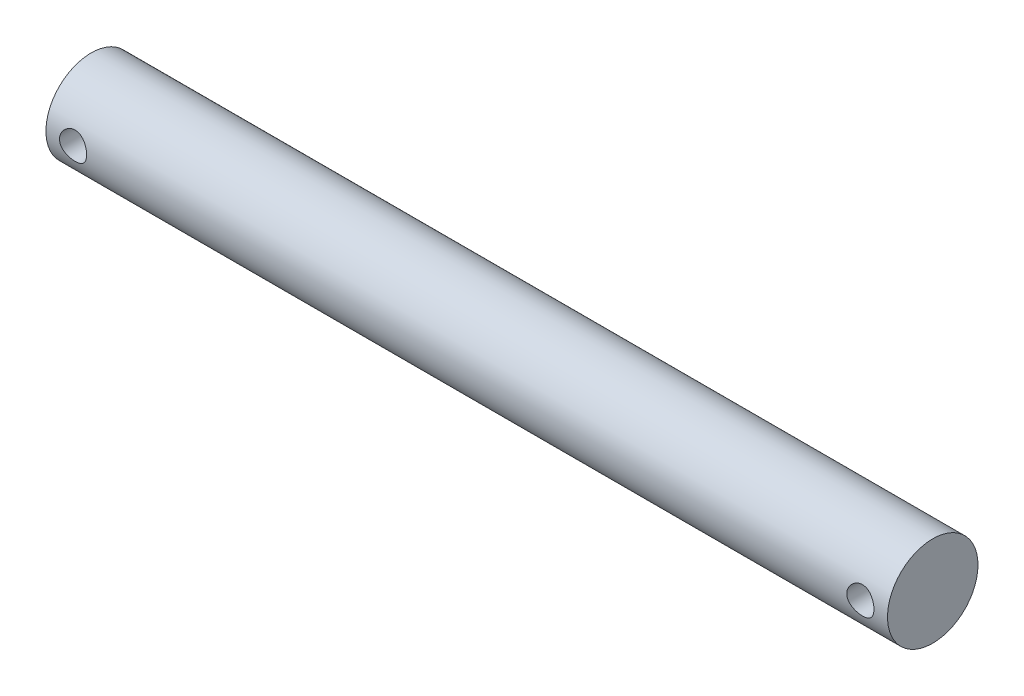
ISO-10303-21;
HEADER;
FILE_DESCRIPTION(('STEP AP214'),'2;1');
FILE_NAME('part.step','',(''),(''),'','','');
FILE_SCHEMA(('AUTOMOTIVE_DESIGN { 1 0 10303 214 1 1 1 1 }'));
ENDSEC;
DATA;
#1=APPLICATION_CONTEXT('core data for automotive mechanical design processes');
#2=APPLICATION_PROTOCOL_DEFINITION('international standard','automotive_design',2000,#1);
#3=PRODUCT_CONTEXT('',#1,'mechanical');
#4=PRODUCT('Part','Part','',(#3));
#5=PRODUCT_RELATED_PRODUCT_CATEGORY('part','',(#4));
#6=PRODUCT_DEFINITION_FORMATION('','',#4);
#7=PRODUCT_DEFINITION_CONTEXT('part definition',#1,'design');
#8=PRODUCT_DEFINITION('design','',#6,#7);
#9=PRODUCT_DEFINITION_SHAPE('','',#8);
#10=(LENGTH_UNIT() NAMED_UNIT(*) SI_UNIT(.MILLI.,.METRE.));
#11=(NAMED_UNIT(*) PLANE_ANGLE_UNIT() SI_UNIT($,.RADIAN.));
#12=(NAMED_UNIT(*) SI_UNIT($,.STERADIAN.) SOLID_ANGLE_UNIT());
#13=UNCERTAINTY_MEASURE_WITH_UNIT(LENGTH_MEASURE(1.E-05),#10,'distance_accuracy_value','');
#14=(GEOMETRIC_REPRESENTATION_CONTEXT(3) GLOBAL_UNCERTAINTY_ASSIGNED_CONTEXT((#13)) GLOBAL_UNIT_ASSIGNED_CONTEXT((#10,
#11,#12)) REPRESENTATION_CONTEXT('',''));
#15=CARTESIAN_POINT('',(0.,0.,0.));
#16=DIRECTION('',(0.,0.,1.));
#17=DIRECTION('',(1.,0.,0.));
#18=AXIS2_PLACEMENT_3D('',#15,#16,#17);
#19=CARTESIAN_POINT('',(93.0000000000005,1.94289029309402E-13,0.));
#20=DIRECTION('',(-1.,0.,0.));
#21=DIRECTION('',(0.,0.,0.999999999999999));
#22=AXIS2_PLACEMENT_3D('',#19,#20,#21);
#23=CYLINDRICAL_SURFACE('',#22,5.);
#24=CARTESIAN_POINT('',(93.0000000000005,1.94289029309402E-13,0.));
#25=DIRECTION('',(1.,0.,0.));
#26=DIRECTION('',(0.,0.,-0.999999999999999));
#27=AXIS2_PLACEMENT_3D('',#24,#25,#26);
#28=CIRCLE('',#27,5.);
#29=CARTESIAN_POINT('',(93.0000000000005,1.94326380074245E-13,-5.));
#30=VERTEX_POINT('',#29);
#31=EDGE_CURVE('E10',#30,#30,#28,.T.);
#32=ORIENTED_EDGE('',*,*,#31,.F.);
#33=EDGE_LOOP('',(#32));
#34=FACE_BOUND('',#33,.T.);
#35=CARTESIAN_POINT('',(0.,0.,0.));
#36=DIRECTION('',(1.,0.,0.));
#37=DIRECTION('',(0.,0.,-0.999999999999999));
#38=AXIS2_PLACEMENT_3D('',#35,#36,#37);
#39=CIRCLE('',#38,5.);
#40=CARTESIAN_POINT('',(0.,0.,-5.));
#41=VERTEX_POINT('',#40);
#42=EDGE_CURVE('E39',#41,#41,#39,.T.);
#43=ORIENTED_EDGE('',*,*,#42,.T.);
#44=EDGE_LOOP('',(#43));
#45=FACE_BOUND('',#44,.T.);
#46=CARTESIAN_POINT('',(91.5000000000002,0.,-5.00000000000001));
#47=CARTESIAN_POINT('',(91.4999990025153,-0.0822886127532704,-4.9999992925055));
#48=CARTESIAN_POINT('',(91.4932061363765,-0.164587318351527,-4.99794915693953));
#49=CARTESIAN_POINT('',(91.4662786457785,-0.326788125304866,-4.9899710559369));
#50=CARTESIAN_POINT('',(91.4461400419771,-0.406689504411366,-4.98404193389691));
#51=CARTESIAN_POINT('',(91.3932539830902,-0.561732707754503,-4.96895552501835));
#52=CARTESIAN_POINT('',(91.3605251303816,-0.636881364395417,-4.95980300250422));
#53=CARTESIAN_POINT('',(91.2834639069446,-0.780624181053168,-4.93922109237642));
#54=CARTESIAN_POINT('',(91.2391299926049,-0.849217467469631,-4.92779140192065));
#55=CARTESIAN_POINT('',(91.1387759925276,-0.979871797183728,-4.90350737192771));
#56=CARTESIAN_POINT('',(91.0824833741145,-1.04171807124443,-4.8906238365703));
#57=CARTESIAN_POINT('',(90.9603907700902,-1.15524920923319,-4.86505834210438));
#58=CARTESIAN_POINT('',(90.8945891878753,-1.20693236327412,-4.85237641724503));
#59=CARTESIAN_POINT('',(90.7535292469626,-1.29980037723675,-4.82834113993773));
#60=CARTESIAN_POINT('',(90.6780915390096,-1.34072309022203,-4.8170240666387));
#61=CARTESIAN_POINT('',(90.5210107457701,-1.40921394774765,-4.79743620394026));
#62=CARTESIAN_POINT('',(90.4393691560724,-1.43678529919971,-4.78916468313312));
#63=CARTESIAN_POINT('',(90.2746097338699,-1.4770163368264,-4.77690870838436));
#64=CARTESIAN_POINT('',(90.1915972561364,-1.49007196234662,-4.7728106932453));
#65=CARTESIAN_POINT('',(90.0244668437837,-1.50213730614667,-4.76902789749765));
#66=CARTESIAN_POINT('',(89.9403491819413,-1.50115042761088,-4.76934204760575));
#67=CARTESIAN_POINT('',(89.7766160913919,-1.48546977199815,-4.77424744067782));
#68=CARTESIAN_POINT('',(89.6969477496382,-1.47127205262668,-4.77868388599141));
#69=CARTESIAN_POINT('',(89.5411802137268,-1.43037420427039,-4.79108356228623));
#70=CARTESIAN_POINT('',(89.4650813726258,-1.40367284141645,-4.79904714132351));
#71=CARTESIAN_POINT('',(89.3173996503395,-1.33816026653682,-4.81772733074975));
#72=CARTESIAN_POINT('',(89.2458929160452,-1.29918816934619,-4.82848016115955));
#73=CARTESIAN_POINT('',(89.1102679779902,-1.21035222588663,-4.85150987000064));
#74=CARTESIAN_POINT('',(89.0461515705865,-1.16048574002595,-4.86378711746986));
#75=CARTESIAN_POINT('',(88.9243138092383,-1.04881290765561,-4.88911011297932));
#76=CARTESIAN_POINT('',(88.8669713359709,-0.986594907466896,-4.90216654310496));
#77=CARTESIAN_POINT('',(88.7634460159363,-0.853263259313839,-4.92712244063257));
#78=CARTESIAN_POINT('',(88.7172638715859,-0.782149051860926,-4.93902183518406));
#79=CARTESIAN_POINT('',(88.6371400775356,-0.632355038342886,-4.96043160069466));
#80=CARTESIAN_POINT('',(88.6032824837507,-0.553627749747908,-4.96992543668313));
#81=CARTESIAN_POINT('',(88.549400409901,-0.391245415603411,-4.98533521832221));
#82=CARTESIAN_POINT('',(88.5293720714678,-0.307591751589533,-4.99125216186997));
#83=CARTESIAN_POINT('',(88.5043478221009,-0.140952242668331,-4.99868364643536));
#84=CARTESIAN_POINT('',(88.498838414199,-0.0580500976011801,-5.0003485041779));
#85=CARTESIAN_POINT('',(88.5015691557126,0.107499605823416,-4.9995292324176));
#86=CARTESIAN_POINT('',(88.5098074696517,0.190147196690833,-4.99704565677755));
#87=CARTESIAN_POINT('',(88.5393846111117,0.35090360530971,-4.98830696987162));
#88=CARTESIAN_POINT('',(88.5604233875814,0.429072772614126,-4.98213829799418));
#89=CARTESIAN_POINT('',(88.6146432327788,0.580754638954529,-4.96674347841535));
#90=CARTESIAN_POINT('',(88.6478257610382,0.654266777025698,-4.95751696321087));
#91=CARTESIAN_POINT('',(88.7262531654814,0.796437189461157,-4.93669654351328));
#92=CARTESIAN_POINT('',(88.7717593409484,0.864943826199656,-4.9250528082968));
#93=CARTESIAN_POINT('',(88.8732247540533,0.993523307980053,-4.90073468764321));
#94=CARTESIAN_POINT('',(88.929186611888,1.05359403235588,-4.88806004431079));
#95=CARTESIAN_POINT('',(89.0523873083697,1.16585744551026,-4.86253171869139));
#96=CARTESIAN_POINT('',(89.1199618757721,1.21768481231502,-4.84968825033274));
#97=CARTESIAN_POINT('',(89.2631279390139,1.30928995072153,-4.82576515238467));
#98=CARTESIAN_POINT('',(89.3387192245586,1.34906803829472,-4.81468547654648));
#99=CARTESIAN_POINT('',(89.4955324912551,1.41517347127171,-4.79567189615051));
#100=CARTESIAN_POINT('',(89.576726186537,1.44156346937056,-4.7877233784383));
#101=CARTESIAN_POINT('',(89.7426879689318,1.4802173081512,-4.77591594362798));
#102=CARTESIAN_POINT('',(89.827454820788,1.49248598978781,-4.77205562508298));
#103=CARTESIAN_POINT('',(89.9943615183766,1.50221984485064,-4.76899972496083));
#104=CARTESIAN_POINT('',(90.076463651018,1.500280553085,-4.76961647442757));
#105=CARTESIAN_POINT('',(90.2391141033733,1.48307505444827,-4.77499401288296));
#106=CARTESIAN_POINT('',(90.3196624851769,1.46780938124728,-4.77975463592547));
#107=CARTESIAN_POINT('',(90.4759453991434,1.42476888804148,-4.79275763670381));
#108=CARTESIAN_POINT('',(90.5517272873622,1.39715175507083,-4.80095604545965));
#109=CARTESIAN_POINT('',(90.6976424388182,1.33031507121141,-4.81990278909139));
#110=CARTESIAN_POINT('',(90.7677746176412,1.29109329962884,-4.83065161194312));
#111=CARTESIAN_POINT('',(90.9031631165276,1.20048763805083,-4.85397676425832));
#112=CARTESIAN_POINT('',(90.968148761261,1.14871276093014,-4.86660540163798));
#113=CARTESIAN_POINT('',(91.0887024983083,1.03517434629794,-4.89201320450026));
#114=CARTESIAN_POINT('',(91.1442681394681,0.973408217134454,-4.90479240823902));
#115=CARTESIAN_POINT('',(91.2460234122954,0.839465762183162,-4.92950936570646));
#116=CARTESIAN_POINT('',(91.291891446856,0.767037885790666,-4.94141159765674));
#117=CARTESIAN_POINT('',(91.3707351699046,0.615141373983711,-4.96260680455815));
#118=CARTESIAN_POINT('',(91.403716888275,0.535676052999117,-4.97190099931069));
#119=CARTESIAN_POINT('',(91.4528952756533,0.380757712655445,-4.98602174969302));
#120=CARTESIAN_POINT('',(91.4705116728839,0.30578696195441,-4.99122027381068));
#121=CARTESIAN_POINT('',(91.4940635252421,0.153880195230924,-4.99820944494492));
#122=CARTESIAN_POINT('',(91.500000932705,0.07694450985824,-5.00000066154741));
#123=CARTESIAN_POINT('',(91.5000000000002,0.,-5.00000000000001));
#124=B_SPLINE_CURVE_WITH_KNOTS('',3,(#46,#47,#48,#49,#50,#51,#52,#53,#54,#55,#56,#57,#58,#59,
#60,#61,#62,#63,#64,#65,#66,#67,#68,#69,#70,#71,#72,#73,#74,#75,#76,#77,#78,#79,#80,#81,#82,#83,
#84,#85,#86,#87,#88,#89,#90,#91,#92,#93,#94,#95,#96,#97,#98,#99,#100,#101,#102,#103,#104,#105,
#106,#107,#108,#109,#110,#111,#112,#113,#114,#115,#116,#117,#118,#119,#120,#121,#122,#123),
.UNSPECIFIED.,.T.,.F.,(4,2,2,2,2,2,2,2,2,2,2,2,2,2,2,2,2,2,2,2,2,2,2,2,2,2,2,2,2,2,2,2,2,2,2,2,
2,2,4),(0.,0.246583203612636,0.493239964845997,0.739533676300944,0.985860164412863,
1.23855602948198,1.49129437288632,1.74971481004111,2.00807314543228,2.25919689356598,
2.51025978319083,2.75226016697681,2.99428443658018,3.23962426447126,3.48502360158549,
3.74067104048159,3.99633456531062,4.25371046881683,4.51101453528805,4.75908809438539,
5.00712853550317,5.24956746682321,5.49203554593727,5.740113057029,5.98825282000174,
6.24540400322809,6.50254844252675,6.75847814951242,7.0143200946027,7.25950155466941,
7.50467319661609,7.74680040402727,7.98897397553108,8.23996925679931,8.49102974897509,
8.74942996156676,9.00770911595231,9.23831691930457,9.46888616948881),.UNSPECIFIED.);
#125=CARTESIAN_POINT('',(91.5000000000002,0.,-5.00000000000001));
#126=VERTEX_POINT('',#125);
#127=EDGE_CURVE('E57',#126,#126,#124,.T.);
#128=ORIENTED_EDGE('',*,*,#127,.F.);
#129=EDGE_LOOP('',(#128));
#130=FACE_BOUND('',#129,.T.);
#131=CARTESIAN_POINT('',(88.5000000000001,-1.66533453693773E-13,5.));
#132=CARTESIAN_POINT('',(88.500000997485,0.0822886127531094,4.99999929250551));
#133=CARTESIAN_POINT('',(88.5067938636244,0.16458731835131,4.99794915693956));
#134=CARTESIAN_POINT('',(88.5337213542226,0.326788125304686,4.98997105593692));
#135=CARTESIAN_POINT('',(88.5538599580236,0.406689504411278,4.98404193389689));
#136=CARTESIAN_POINT('',(88.6067460169104,0.561732707754454,4.96895552501835));
#137=CARTESIAN_POINT('',(88.6394748696193,0.636881364395313,4.95980300250428));
#138=CARTESIAN_POINT('',(88.7165360930563,0.780624181053171,4.93922109237648));
#139=CARTESIAN_POINT('',(88.7608700073959,0.849217467469795,4.92779140192065));
#140=CARTESIAN_POINT('',(88.8612240074732,0.97987179718391,4.90350737192771));
#141=CARTESIAN_POINT('',(88.9175166258864,1.04171807124446,4.89062383657037));
#142=CARTESIAN_POINT('',(89.0396092299107,1.15524920923336,4.86505834210445));
#143=CARTESIAN_POINT('',(89.1054108121254,1.20693236327458,4.85237641724502));
#144=CARTESIAN_POINT('',(89.246470753038,1.29980037723723,4.82834113993773));
#145=CARTESIAN_POINT('',(89.3219084609912,1.34072309022222,4.81702406663878));
#146=CARTESIAN_POINT('',(89.4789892542307,1.40921394774769,4.79743620394034));
#147=CARTESIAN_POINT('',(89.5606308439284,1.43678529919989,4.78916468313311));
#148=CARTESIAN_POINT('',(89.7253902661309,1.47701633682667,4.77690870838434));
#149=CARTESIAN_POINT('',(89.8084027438644,1.49007196234687,4.77281069324535));
#150=CARTESIAN_POINT('',(89.9755331562172,1.50213730614683,4.76902789749771));
#151=CARTESIAN_POINT('',(90.0596508180595,1.50115042761096,4.76934204760574));
#152=CARTESIAN_POINT('',(90.2233839086089,1.48546977199832,4.7742474406778));
#153=CARTESIAN_POINT('',(90.3030522503626,1.47127205262703,4.77868388599142));
#154=CARTESIAN_POINT('',(90.4588197862738,1.43037420427068,4.79108356228625));
#155=CARTESIAN_POINT('',(90.5349186273746,1.40367284141651,4.79904714132351));
#156=CARTESIAN_POINT('',(90.682600349661,1.33816026653699,4.81772733074973));
#157=CARTESIAN_POINT('',(90.7541070839556,1.2991881693467,4.82848016115953));
#158=CARTESIAN_POINT('',(90.8897320220105,1.21035222588702,4.85150987000062));
#159=CARTESIAN_POINT('',(90.9538484294139,1.1604857400259,4.86378711746985));
#160=CARTESIAN_POINT('',(91.0756861907622,1.04881290765548,4.88911011297931));
#161=CARTESIAN_POINT('',(91.13302866403,0.986594907467184,4.90216654310496));
#162=CARTESIAN_POINT('',(91.2365539840646,0.853263259314285,4.92712244063257));
#163=CARTESIAN_POINT('',(91.2827361284147,0.782149051861117,4.93902183518405));
#164=CARTESIAN_POINT('',(91.362859922465,0.632355038343,4.96043160069465));
#165=CARTESIAN_POINT('',(91.3967175162503,0.553627749748202,4.96992543668313));
#166=CARTESIAN_POINT('',(91.4505995901001,0.391245415603748,4.98533521832222));
#167=CARTESIAN_POINT('',(91.4706279285327,0.307591751589734,4.99125216186996));
#168=CARTESIAN_POINT('',(91.4956521778997,0.140952242668422,4.99868364643535));
#169=CARTESIAN_POINT('',(91.5011615858021,0.0580500976012905,5.0003485041779));
#170=CARTESIAN_POINT('',(91.4984308442884,-0.107499605823242,4.9995292324176));
#171=CARTESIAN_POINT('',(91.4901925303488,-0.190147196690615,4.99704565677755));
#172=CARTESIAN_POINT('',(91.4606153888887,-0.350903605309558,4.98830696987161));
#173=CARTESIAN_POINT('',(91.4395766124196,-0.429072772614081,4.98213829799415));
#174=CARTESIAN_POINT('',(91.3853567672223,-0.5807546389544,4.96674347841533));
#175=CARTESIAN_POINT('',(91.3521742389625,-0.654266777025378,4.95751696321086));
#176=CARTESIAN_POINT('',(91.2737468345192,-0.796437189460875,4.93669654351325));
#177=CARTESIAN_POINT('',(91.2282406590525,-0.864943826199604,4.92505280829673));
#178=CARTESIAN_POINT('',(91.1267752459476,-0.993523307980039,4.90073468764315));
#179=CARTESIAN_POINT('',(91.0708133881126,-1.05359403235567,4.8880600443108));
#180=CARTESIAN_POINT('',(90.9476126916308,-1.16585744551002,4.86253171869137));
#181=CARTESIAN_POINT('',(90.8800381242286,-1.21768481231497,4.84968825033265));
#182=CARTESIAN_POINT('',(90.7368720609869,-1.30928995072153,4.82576515238458));
#183=CARTESIAN_POINT('',(90.6612807754422,-1.34906803829459,4.81468547654645));
#184=CARTESIAN_POINT('',(90.5044675087456,-1.41517347127149,4.7956718961505));
#185=CARTESIAN_POINT('',(90.4232738134638,-1.44156346937037,4.78772337843824));
#186=CARTESIAN_POINT('',(90.2573120310689,-1.48021730815109,4.77591594362791));
#187=CARTESIAN_POINT('',(90.1725451792128,-1.49248598978776,4.77205562508296));
#188=CARTESIAN_POINT('',(90.0056384816242,-1.50221984485052,4.76899972496083));
#189=CARTESIAN_POINT('',(89.9235363489829,-1.50028055308478,4.76961647442753));
#190=CARTESIAN_POINT('',(89.7608858966276,-1.48307505444802,4.77499401288292));
#191=CARTESIAN_POINT('',(89.6803375148241,-1.46780938124709,4.77975463592546));
#192=CARTESIAN_POINT('',(89.5240546008576,-1.42476888804126,4.79275763670381));
#193=CARTESIAN_POINT('',(89.4482727126387,-1.3971517550705,4.80095604545964));
#194=CARTESIAN_POINT('',(89.3023575611826,-1.33031507121113,4.81990278909137));
#195=CARTESIAN_POINT('',(89.2322253823594,-1.29109329962871,4.83065161194309));
#196=CARTESIAN_POINT('',(89.0968368834731,-1.20048763805064,4.85397676425831));
#197=CARTESIAN_POINT('',(89.0318512387399,-1.14871276092972,4.86660540163799));
#198=CARTESIAN_POINT('',(88.9112975016925,-1.03517434629758,4.89201320450027));
#199=CARTESIAN_POINT('',(88.8557318605325,-0.97340821713438,4.90479240823902));
#200=CARTESIAN_POINT('',(88.7539765877053,-0.839465762183185,4.92950936570644));
#201=CARTESIAN_POINT('',(88.7081085531449,-0.767037885790476,4.94141159765672));
#202=CARTESIAN_POINT('',(88.6292648300965,-0.615141373983352,4.96260680455814));
#203=CARTESIAN_POINT('',(88.596283111726,-0.535676052998798,4.97190099931067));
#204=CARTESIAN_POINT('',(88.5471047243478,-0.380757712655173,4.98602174969301));
#205=CARTESIAN_POINT('',(88.5294883271174,-0.30578696195416,4.99122027381067));
#206=CARTESIAN_POINT('',(88.5059364747588,-0.153880195230806,4.99820944494491));
#207=CARTESIAN_POINT('',(88.4999990672953,-0.0769445098582341,5.00000066154739));
#208=CARTESIAN_POINT('',(88.5000000000001,-1.66533453693773E-13,5.));
#209=B_SPLINE_CURVE_WITH_KNOTS('',3,(#131,#132,#133,#134,#135,#136,#137,#138,#139,#140,#141,
#142,#143,#144,#145,#146,#147,#148,#149,#150,#151,#152,#153,#154,#155,#156,#157,#158,#159,#160,
#161,#162,#163,#164,#165,#166,#167,#168,#169,#170,#171,#172,#173,#174,#175,#176,#177,#178,#179,
#180,#181,#182,#183,#184,#185,#186,#187,#188,#189,#190,#191,#192,#193,#194,#195,#196,#197,#198,
#199,#200,#201,#202,#203,#204,#205,#206,#207,#208),.UNSPECIFIED.,.T.,.F.,(4,2,2,2,2,2,2,2,2,2,2,
2,2,2,2,2,2,2,2,2,2,2,2,2,2,2,2,2,2,2,2,2,2,2,2,2,2,2,4),(0.,0.246583203612592,
0.493239964845996,0.739533676301079,0.985860164413107,1.23855602948228,1.49129437288665,
1.74971481004139,2.00807314543253,2.2591968935663,2.51025978319119,2.75226016697697,
2.99428443658013,3.23962426447132,3.48502360158571,3.74067104048178,3.99633456531077,
4.25371046881703,4.51101453528831,4.75908809438568,5.0071285355035,5.24956746682347,
5.49203554593743,5.74011305702928,5.98825282000219,6.24540400322844,6.50254844252703,
6.75847814951272,7.01432009460299,7.25950155466958,7.50467319661615,7.74680040402748,
7.98897397553145,8.23996925679964,8.49102974897529,8.74942996156693,9.00770911595257,
9.23831691930469,9.46888616948868),.UNSPECIFIED.);
#210=CARTESIAN_POINT('',(88.5000000000001,-1.66533453693773E-13,5.));
#211=VERTEX_POINT('',#210);
#212=EDGE_CURVE('E48',#211,#211,#209,.T.);
#213=ORIENTED_EDGE('',*,*,#212,.T.);
#214=EDGE_LOOP('',(#213));
#215=FACE_BOUND('',#214,.T.);
#216=CARTESIAN_POINT('',(4.50000000000028,-1.66533453693773E-13,-5.00000000000001));
#217=CARTESIAN_POINT('',(4.49999900251539,-0.0822886127534523,-4.9999992925055));
#218=CARTESIAN_POINT('',(4.49320613637602,-0.164587318351663,-4.99794915693953));
#219=CARTESIAN_POINT('',(4.46627864577784,-0.326788125305058,-4.9899710559369));
#220=CARTESIAN_POINT('',(4.44614004197684,-0.406689504411659,-4.98404193389691));
#221=CARTESIAN_POINT('',(4.39325398308993,-0.561732707754727,-4.96895552501836));
#222=CARTESIAN_POINT('',(4.36052513038103,-0.636881364395473,-4.95980300250425));
#223=CARTESIAN_POINT('',(4.28346390694407,-0.780624181053241,-4.93922109237644));
#224=CARTESIAN_POINT('',(4.23912999260467,-0.849217467469889,-4.92779140192065));
#225=CARTESIAN_POINT('',(4.13877599252746,-0.979871797183912,-4.90350737192773));
#226=CARTESIAN_POINT('',(4.08248337411407,-1.04171807124434,-4.89062383657036));
#227=CARTESIAN_POINT('',(3.96039077008983,-1.15524920923323,-4.86505834210444));
#228=CARTESIAN_POINT('',(3.89458918787523,-1.20693236327456,-4.85237641724503));
#229=CARTESIAN_POINT('',(3.75352924696266,-1.29980037723723,-4.82834113993774));
#230=CARTESIAN_POINT('',(3.67809153900943,-1.34072309022211,-4.81702406663877));
#231=CARTESIAN_POINT('',(3.52101074576981,-1.40921394774751,-4.79743620394033));
#232=CARTESIAN_POINT('',(3.43936915607217,-1.43678529919974,-4.78916468313312));
#233=CARTESIAN_POINT('',(3.27460973386973,-1.47701633682656,-4.77690870838435));
#234=CARTESIAN_POINT('',(3.19159725613626,-1.49007196234676,-4.77281069324534));
#235=CARTESIAN_POINT('',(3.02446684378348,-1.50213730614671,-4.7690278974977));
#236=CARTESIAN_POINT('',(2.94034918194119,-1.50115042761084,-4.76934204760576));
#237=CARTESIAN_POINT('',(2.77661609139183,-1.48546977199822,-4.7742474406778));
#238=CARTESIAN_POINT('',(2.69694774963807,-1.47127205262693,-4.77868388599139));
#239=CARTESIAN_POINT('',(2.54118021372684,-1.43037420427064,-4.79108356228622));
#240=CARTESIAN_POINT('',(2.46508137262596,-1.40367284141651,-4.79904714132352));
#241=CARTESIAN_POINT('',(2.31739965033954,-1.33816026653696,-4.81772733074974));
#242=CARTESIAN_POINT('',(2.245892916045,-1.29918816934659,-4.8284801611595));
#243=CARTESIAN_POINT('',(2.11026797799008,-1.21035222588703,-4.85150987000059));
#244=CARTESIAN_POINT('',(2.0461515705865,-1.16048574002611,-4.86378711746987));
#245=CARTESIAN_POINT('',(1.92431380923821,-1.04881290765574,-4.88911011297933));
#246=CARTESIAN_POINT('',(1.86697133597051,-0.986594907467275,-4.90216654310493));
#247=CARTESIAN_POINT('',(1.76344601593598,-0.853263259314216,-4.92712244063254));
#248=CARTESIAN_POINT('',(1.7172638715859,-0.782149051861054,-4.93902183518406));
#249=CARTESIAN_POINT('',(1.63714007753553,-0.632355038342926,-4.96043160069468));
#250=CARTESIAN_POINT('',(1.60328248375023,-0.553627749748111,-4.96992543668313));
#251=CARTESIAN_POINT('',(1.54940040990037,-0.391245415603684,-4.98533521832221));
#252=CARTESIAN_POINT('',(1.52937207146757,-0.307591751589713,-4.99125216186997));
#253=CARTESIAN_POINT('',(1.50434782210063,-0.140952242668434,-4.99868364643537));
#254=CARTESIAN_POINT('',(1.4988384141983,-0.0580500976012934,-5.0003485041779));
#255=CARTESIAN_POINT('',(1.50156915571215,0.10749960582324,-4.9995292324176));
#256=CARTESIAN_POINT('',(1.50980746965177,0.190147196690605,-4.99704565677756));
#257=CARTESIAN_POINT('',(1.53938461111178,0.350903605309579,-4.98830696987162));
#258=CARTESIAN_POINT('',(1.56042338758086,0.42907277261414,-4.98213829799416));
#259=CARTESIAN_POINT('',(1.61464323277816,0.580754638954455,-4.96674347841534));
#260=CARTESIAN_POINT('',(1.6478257610381,0.654266777025392,-4.95751696321088));
#261=CARTESIAN_POINT('',(1.72625316548141,0.796437189460913,-4.93669654351327));
#262=CARTESIAN_POINT('',(1.77175934094802,0.864943826199712,-4.92505280829674));
#263=CARTESIAN_POINT('',(1.87322475405284,0.993523307980223,-4.90073468764316));
#264=CARTESIAN_POINT('',(1.92918661188792,1.05359403235586,-4.88806004431081));
#265=CARTESIAN_POINT('',(2.05238730836967,1.16585744551021,-4.86253171869139));
#266=CARTESIAN_POINT('',(2.11996187577191,1.21768481231515,-4.84968825033266));
#267=CARTESIAN_POINT('',(2.26312793901365,1.30928995072161,-4.82576515238459));
#268=CARTESIAN_POINT('',(2.33871922455843,1.34906803829458,-4.81468547654647));
#269=CARTESIAN_POINT('',(2.49553249125494,1.41517347127153,-4.79567189615052));
#270=CARTESIAN_POINT('',(2.57672618653678,1.44156346937054,-4.78772337843825));
#271=CARTESIAN_POINT('',(2.74268796893165,1.48021730815119,-4.77591594362792));
#272=CARTESIAN_POINT('',(2.82745482078787,1.49248598978765,-4.77205562508297));
#273=CARTESIAN_POINT('',(2.99436151837647,1.50221984485041,-4.76899972496085));
#274=CARTESIAN_POINT('',(3.07646365101782,1.50028055308485,-4.76961647442755));
#275=CARTESIAN_POINT('',(3.23911410337304,1.48307505444814,-4.77499401288294));
#276=CARTESIAN_POINT('',(3.31966248517659,1.46780938124708,-4.77975463592547));
#277=CARTESIAN_POINT('',(3.4759453991431,1.42476888804122,-4.79275763670382));
#278=CARTESIAN_POINT('',(3.55172728736195,1.39715175507055,-4.80095604545967));
#279=CARTESIAN_POINT('',(3.69764243881801,1.33031507121117,-4.8199027890914));
#280=CARTESIAN_POINT('',(3.76777461764107,1.29109329962864,-4.83065161194311));
#281=CARTESIAN_POINT('',(3.9031631165274,1.20048763805055,-4.85397676425833));
#282=CARTESIAN_POINT('',(3.96814876126064,1.14871276092974,-4.86660540163802));
#283=CARTESIAN_POINT('',(4.08870249830806,1.0351743462976,-4.8920132045003));
#284=CARTESIAN_POINT('',(4.14426813946798,0.973408217134293,-4.90479240823903));
#285=CARTESIAN_POINT('',(4.2460234122952,0.839465762183022,-4.92950936570646));
#286=CARTESIAN_POINT('',(4.29189144685557,0.767037885790348,-4.94141159765676));
#287=CARTESIAN_POINT('',(4.37073516990418,0.615141373983292,-4.96260680455818));
#288=CARTESIAN_POINT('',(4.40371688827482,0.535676052998772,-4.97190099931069));
#289=CARTESIAN_POINT('',(4.45289527565297,0.38075771265511,-4.98602174969302));
#290=CARTESIAN_POINT('',(4.47051167288326,0.305786961954031,-4.99122027381068));
#291=CARTESIAN_POINT('',(4.49406352524162,0.153880195230566,-4.99820944494493));
#292=CARTESIAN_POINT('',(4.5000009327051,0.0769445098579479,-5.00000066154741));
#293=CARTESIAN_POINT('',(4.50000000000028,-1.66533453693773E-13,-5.00000000000001));
#294=B_SPLINE_CURVE_WITH_KNOTS('',3,(#216,#217,#218,#219,#220,#221,#222,#223,#224,#225,#226,
#227,#228,#229,#230,#231,#232,#233,#234,#235,#236,#237,#238,#239,#240,#241,#242,#243,#244,#245,
#246,#247,#248,#249,#250,#251,#252,#253,#254,#255,#256,#257,#258,#259,#260,#261,#262,#263,#264,
#265,#266,#267,#268,#269,#270,#271,#272,#273,#274,#275,#276,#277,#278,#279,#280,#281,#282,#283,
#284,#285,#286,#287,#288,#289,#290,#291,#292,#293),.UNSPECIFIED.,.T.,.F.,(4,2,2,2,2,2,2,2,2,2,2,
2,2,2,2,2,2,2,2,2,2,2,2,2,2,2,2,2,2,2,2,2,2,2,2,2,2,2,4),(0.,0.246583203612626,
0.493239964846027,0.739533676300891,0.985860164412719,1.23855602948184,1.49129437288615,
1.74971481004091,2.00807314543207,2.25919689356575,2.51025978319056,2.75226016697643,
2.9942844365797,3.23962426447086,3.48502360158517,3.7406710404813,3.99633456531041,
4.25371046881668,4.51101453528792,4.75908809438527,5.0071285355031,5.24956746682312,
5.49203554593712,5.740113057029,5.98825282000193,6.24540400322817,6.50254844252675,
6.75847814951248,7.0143200946028,7.25950155466941,7.50467319661599,7.74680040402725,
7.98897397553116,8.23996925679936,8.49102974897506,8.74942996156674,9.00770911595237,
9.23831691930459,9.46888616948871),.UNSPECIFIED.);
#295=CARTESIAN_POINT('',(4.50000000000028,-1.66533453693773E-13,-5.00000000000001));
#296=VERTEX_POINT('',#295);
#297=EDGE_CURVE('E56',#296,#296,#294,.T.);
#298=ORIENTED_EDGE('',*,*,#297,.F.);
#299=EDGE_LOOP('',(#298));
#300=FACE_BOUND('',#299,.T.);
#301=CARTESIAN_POINT('',(1.50000000000027,-2.77555756156289E-13,5.));
#302=CARTESIAN_POINT('',(1.50000099748515,0.0822886127530453,4.9999992925055));
#303=CARTESIAN_POINT('',(1.50679386362412,0.164587318351302,4.99794915693955));
#304=CARTESIAN_POINT('',(1.53372135422229,0.326788125304661,4.98997105593691));
#305=CARTESIAN_POINT('',(1.55385995802368,0.406689504411179,4.98404193389689));
#306=CARTESIAN_POINT('',(1.60674601691063,0.561732707754301,4.96895552501835));
#307=CARTESIAN_POINT('',(1.63947486961919,0.636881364395184,4.95980300250428));
#308=CARTESIAN_POINT('',(1.71653609305599,0.78062418105296,4.93922109237647));
#309=CARTESIAN_POINT('',(1.76087000739557,0.84921746746948,4.92779140192063));
#310=CARTESIAN_POINT('',(1.86122400747285,0.979871797183514,4.90350737192771));
#311=CARTESIAN_POINT('',(1.91751662588611,1.04171807124409,4.8906238365704));
#312=CARTESIAN_POINT('',(2.03960922991034,1.15524920923301,4.86505834210448));
#313=CARTESIAN_POINT('',(2.10541081212506,1.20693236327424,4.85237641724502));
#314=CARTESIAN_POINT('',(2.2464707530377,1.29980037723689,4.82834113993774));
#315=CARTESIAN_POINT('',(2.32190846099087,1.34072309022187,4.81702406663882));
#316=CARTESIAN_POINT('',(2.47898925423042,1.40921394774734,4.79743620394037));
#317=CARTESIAN_POINT('',(2.56063084392806,1.43678529919955,4.7891646831331));
#318=CARTESIAN_POINT('',(2.72539026613053,1.47701633682635,4.77690870838434));
#319=CARTESIAN_POINT('',(2.80840274386405,1.49007196234654,4.7728106932454));
#320=CARTESIAN_POINT('',(2.97553315621692,1.50213730614645,4.76902789749775));
#321=CARTESIAN_POINT('',(3.05965081805926,1.50115042761056,4.76934204760574));
#322=CARTESIAN_POINT('',(3.22338390860867,1.48546977199789,4.77424744067781));
#323=CARTESIAN_POINT('',(3.30305225036242,1.47127205262658,4.77868388599148));
#324=CARTESIAN_POINT('',(3.45881978627369,1.43037420427031,4.79108356228631));
#325=CARTESIAN_POINT('',(3.53491862737461,1.40367284141623,4.79904714132351));
#326=CARTESIAN_POINT('',(3.68260034966098,1.33816026653663,4.81772733074974));
#327=CARTESIAN_POINT('',(3.75410708395542,1.29918816934616,4.82848016115959));
#328=CARTESIAN_POINT('',(3.88973202201036,1.21035222588661,4.85150987000069));
#329=CARTESIAN_POINT('',(3.95384842941402,1.16048574002578,4.86378711746986));
#330=CARTESIAN_POINT('',(4.07568619076226,1.0488129076554,4.88911011297931));
#331=CARTESIAN_POINT('',(4.13302866402982,0.98659490746682,4.90216654310501));
#332=CARTESIAN_POINT('',(4.23655398406435,0.85326325931373,4.92712244063262));
#333=CARTESIAN_POINT('',(4.28273612841456,0.782149051860654,4.93902183518406));
#334=CARTESIAN_POINT('',(4.3628599224649,0.632355038342569,4.96043160069465));
#335=CARTESIAN_POINT('',(4.39671751625002,0.553627749747713,4.96992543668315));
#336=CARTESIAN_POINT('',(4.4505995900998,0.391245415603283,4.98533521832225));
#337=CARTESIAN_POINT('',(4.47062792853267,0.30759175158935,4.99125216186997));
#338=CARTESIAN_POINT('',(4.49565217789958,0.140952242668109,4.99868364643535));
#339=CARTESIAN_POINT('',(4.50116158580179,0.0580500976009686,5.00034850417789));
#340=CARTESIAN_POINT('',(4.49843084428807,-0.107499605823597,4.9995292324176));
#341=CARTESIAN_POINT('',(4.4901925303487,-0.190147196690994,4.99704565677756));
#342=CARTESIAN_POINT('',(4.46061538888865,-0.350903605309885,4.98830696987161));
#343=CARTESIAN_POINT('',(4.43957661241931,-0.429072772614333,4.98213829799414));
#344=CARTESIAN_POINT('',(4.38535676722204,-0.580754638954638,4.96674347841532));
#345=CARTESIAN_POINT('',(4.35217423896241,-0.654266777025676,4.95751696321087));
#346=CARTESIAN_POINT('',(4.27374683451918,-0.796437189461156,4.93669654351326));
#347=CARTESIAN_POINT('',(4.22824065905233,-0.864943826199803,4.92505280829673));
#348=CARTESIAN_POINT('',(4.1267752459474,-0.993523307980286,4.90073468764315));
#349=CARTESIAN_POINT('',(4.07081338811246,-1.05359403235605,4.88806004431081));
#350=CARTESIAN_POINT('',(3.94761269163077,-1.1658574455104,4.86253171869138));
#351=CARTESIAN_POINT('',(3.88003812422846,-1.21768481231521,4.84968825033264));
#352=CARTESIAN_POINT('',(3.73687206098678,-1.30928995072175,4.82576515238458));
#353=CARTESIAN_POINT('',(3.66128077544213,-1.34906803829493,4.81468547654646));
#354=CARTESIAN_POINT('',(3.50446750874567,-1.4151734712719,4.7956718961505));
#355=CARTESIAN_POINT('',(3.42327381346375,-1.44156346937072,4.7877233784382));
#356=CARTESIAN_POINT('',(3.2573120310688,-1.48021730815135,4.77591594362789));
#357=CARTESIAN_POINT('',(3.17254517921258,-1.49248598978797,4.77205562508297));
#358=CARTESIAN_POINT('',(3.00563848162398,-1.5022198448508,4.76899972496083));
#359=CARTESIAN_POINT('',(2.92353634898261,-1.50028055308516,4.76961647442748));
#360=CARTESIAN_POINT('',(2.7608858966274,-1.48307505444838,4.77499401288287));
#361=CARTESIAN_POINT('',(2.68033751482386,-1.46780938124733,4.77975463592546));
#362=CARTESIAN_POINT('',(2.52405460085734,-1.42476888804153,4.79275763670381));
#363=CARTESIAN_POINT('',(2.44827271263846,-1.39715175507093,4.80095604545958));
#364=CARTESIAN_POINT('',(2.30235756118242,-1.33031507121153,4.81990278909131));
#365=CARTESIAN_POINT('',(2.23222538235943,-1.29109329962893,4.83065161194309));
#366=CARTESIAN_POINT('',(2.09683688347307,-1.20048763805087,4.85397676425831));
#367=CARTESIAN_POINT('',(2.03185123873971,-1.14871276093017,4.86660540163794));
#368=CARTESIAN_POINT('',(1.9112975016923,-1.03517434629805,4.89201320450021));
#369=CARTESIAN_POINT('',(1.8557318605325,-0.973408217134665,4.90479240823901));
#370=CARTESIAN_POINT('',(1.75397658770522,-0.839465762183387,4.92950936570646));
#371=CARTESIAN_POINT('',(1.70810855314466,-0.767037885790793,4.94141159765671));
#372=CARTESIAN_POINT('',(1.62926483009609,-0.615141373983718,4.96260680455812));
#373=CARTESIAN_POINT('',(1.59628311172568,-0.535676052999101,4.97190099931067));
#374=CARTESIAN_POINT('',(1.54710472434744,-0.380757712655424,4.98602174969301));
#375=CARTESIAN_POINT('',(1.52948832711689,-0.305786961954414,4.99122027381067));
#376=CARTESIAN_POINT('',(1.5059364747586,-0.153880195231018,4.99820944494491));
#377=CARTESIAN_POINT('',(1.49999906729546,-0.0769445098583993,5.00000066154739));
#378=CARTESIAN_POINT('',(1.50000000000027,-2.77555756156289E-13,5.));
#379=B_SPLINE_CURVE_WITH_KNOTS('',3,(#301,#302,#303,#304,#305,#306,#307,#308,#309,#310,#311,
#312,#313,#314,#315,#316,#317,#318,#319,#320,#321,#322,#323,#324,#325,#326,#327,#328,#329,#330,
#331,#332,#333,#334,#335,#336,#337,#338,#339,#340,#341,#342,#343,#344,#345,#346,#347,#348,#349,
#350,#351,#352,#353,#354,#355,#356,#357,#358,#359,#360,#361,#362,#363,#364,#365,#366,#367,#368,
#369,#370,#371,#372,#373,#374,#375,#376,#377,#378),.UNSPECIFIED.,.T.,.F.,(4,2,2,2,2,2,2,2,2,2,2,
2,2,2,2,2,2,2,2,2,2,2,2,2,2,2,2,2,2,2,2,2,2,2,2,2,2,2,4),(0.,0.246583203612654,
0.493239964846095,0.739533676300943,0.985860164412732,1.23855602948192,1.49129437288631,
1.74971481004105,2.00807314543217,2.25919689356597,2.51025978319093,2.75226016697683,
2.99428443658011,3.23962426447124,3.48502360158553,3.74067104048166,3.99633456531076,
4.25371046881694,4.51101453528812,4.75908809438548,5.0071285355033,5.24956746682322,
5.49203554593712,5.740113057029,5.98825282000194,6.24540400322814,6.50254844252664,
6.75847814951243,7.01432009460283,7.25950155466945,7.50467319661602,7.74680040402726,
7.98897397553115,8.23996925679936,8.49102974897505,8.74942996156678,9.00770911595247,
9.23831691930464,9.46888616948871),.UNSPECIFIED.);
#380=CARTESIAN_POINT('',(1.50000000000027,-2.77555756156289E-13,5.));
#381=VERTEX_POINT('',#380);
#382=EDGE_CURVE('E46',#381,#381,#379,.T.);
#383=ORIENTED_EDGE('',*,*,#382,.T.);
#384=EDGE_LOOP('',(#383));
#385=FACE_BOUND('',#384,.T.);
#386=ADVANCED_FACE('F36',(#34,#45,#130,#215,#300,#385),#23,.T.);
#387=CARTESIAN_POINT('',(93.0000000000005,1.94289029309402E-13,0.));
#388=DIRECTION('',(1.,0.,0.));
#389=DIRECTION('',(0.,0.,-0.999999999999999));
#390=AXIS2_PLACEMENT_3D('',#387,#388,#389);
#391=PLANE('',#390);
#392=ORIENTED_EDGE('',*,*,#31,.T.);
#393=EDGE_LOOP('',(#392));
#394=FACE_BOUND('',#393,.T.);
#395=ADVANCED_FACE('F95',(#394),#391,.T.);
#396=CARTESIAN_POINT('',(0.,0.,0.));
#397=DIRECTION('',(1.,0.,0.));
#398=DIRECTION('',(0.,0.,-0.999999999999999));
#399=AXIS2_PLACEMENT_3D('',#396,#397,#398);
#400=PLANE('',#399);
#401=ORIENTED_EDGE('',*,*,#42,.F.);
#402=EDGE_LOOP('',(#401));
#403=FACE_BOUND('',#402,.T.);
#404=ADVANCED_FACE('F101',(#403),#400,.F.);
#405=CARTESIAN_POINT('',(90.0000000000005,1.11022302462516E-13,5.00100000000003));
#406=DIRECTION('',(0.,0.,-0.999999999999999));
#407=DIRECTION('',(-1.,0.,0.));
#408=AXIS2_PLACEMENT_3D('',#405,#406,#407);
#409=CYLINDRICAL_SURFACE('',#408,1.5);
#410=ORIENTED_EDGE('',*,*,#212,.F.);
#411=EDGE_LOOP('',(#410));
#412=FACE_BOUND('',#411,.T.);
#413=ORIENTED_EDGE('',*,*,#127,.T.);
#414=EDGE_LOOP('',(#413));
#415=FACE_BOUND('',#414,.T.);
#416=ADVANCED_FACE('F64',(#412,#415),#409,.F.);
#417=CARTESIAN_POINT('',(3.00000000000017,-2.4980018054066E-13,5.00100000000003));
#418=DIRECTION('',(0.,0.,-0.999999999999999));
#419=DIRECTION('',(-1.,0.,0.));
#420=AXIS2_PLACEMENT_3D('',#417,#418,#419);
#421=CYLINDRICAL_SURFACE('',#420,1.5);
#422=ORIENTED_EDGE('',*,*,#382,.F.);
#423=EDGE_LOOP('',(#422));
#424=FACE_BOUND('',#423,.T.);
#425=ORIENTED_EDGE('',*,*,#297,.T.);
#426=EDGE_LOOP('',(#425));
#427=FACE_BOUND('',#426,.T.);
#428=ADVANCED_FACE('F71',(#424,#427),#421,.F.);
#429=CLOSED_SHELL('',(#386,#395,#404,#416,#428));
#430=MANIFOLD_SOLID_BREP('B2',#429);
#431=ADVANCED_BREP_SHAPE_REPRESENTATION('',(#18,#430),#14);
#432=SHAPE_DEFINITION_REPRESENTATION(#9,#431);
ENDSEC;
END-ISO-10303-21;
